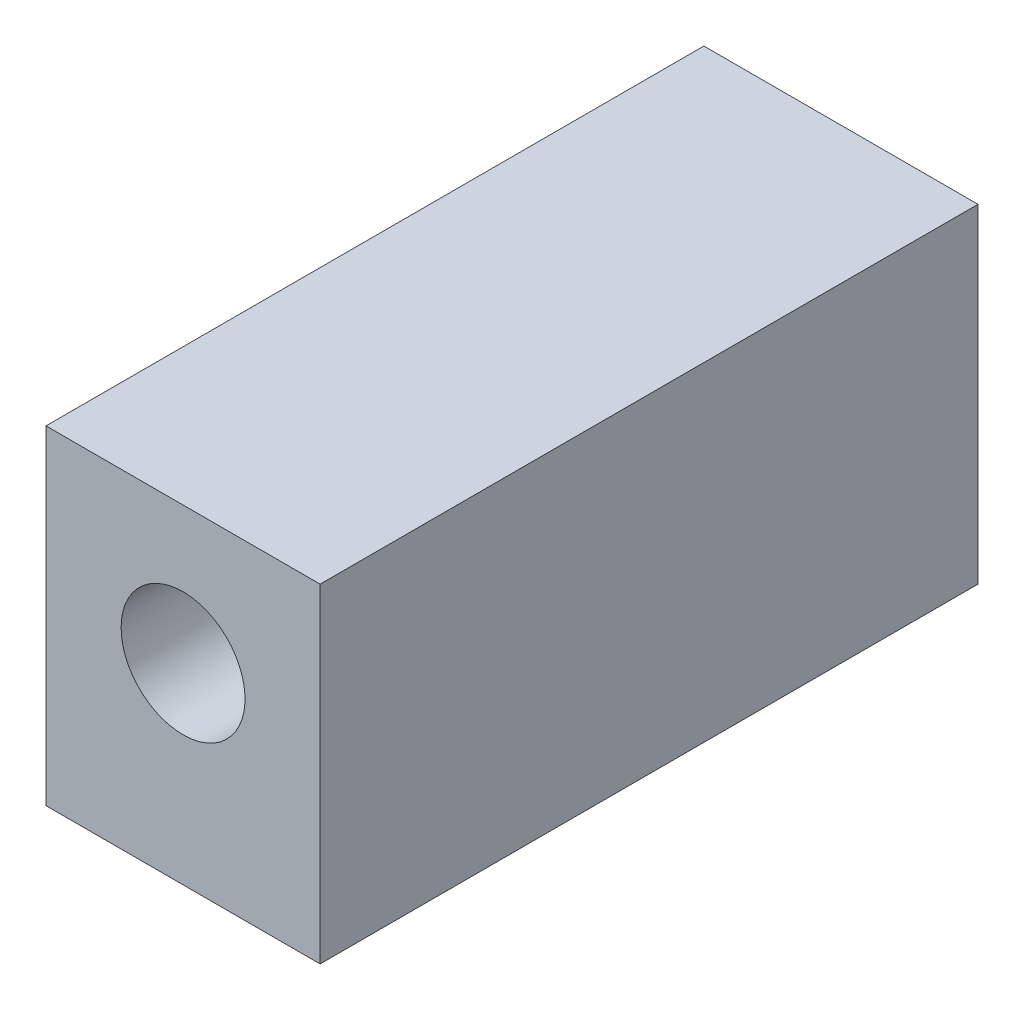
ISO-10303-21;
HEADER;
FILE_DESCRIPTION(('STEP AP214'),'2;1');
FILE_NAME('part.step','',(''),(''),'','','');
FILE_SCHEMA(('AUTOMOTIVE_DESIGN { 1 0 10303 214 1 1 1 1 }'));
ENDSEC;
DATA;
#1=APPLICATION_CONTEXT('core data for automotive mechanical design processes');
#2=APPLICATION_PROTOCOL_DEFINITION('international standard','automotive_design',2000,#1);
#3=PRODUCT_CONTEXT('',#1,'mechanical');
#4=PRODUCT('Part','Part','',(#3));
#5=PRODUCT_RELATED_PRODUCT_CATEGORY('part','',(#4));
#6=PRODUCT_DEFINITION_FORMATION('','',#4);
#7=PRODUCT_DEFINITION_CONTEXT('part definition',#1,'design');
#8=PRODUCT_DEFINITION('design','',#6,#7);
#9=PRODUCT_DEFINITION_SHAPE('','',#8);
#10=(LENGTH_UNIT() NAMED_UNIT(*) SI_UNIT(.MILLI.,.METRE.));
#11=(NAMED_UNIT(*) PLANE_ANGLE_UNIT() SI_UNIT($,.RADIAN.));
#12=(NAMED_UNIT(*) SI_UNIT($,.STERADIAN.) SOLID_ANGLE_UNIT());
#13=UNCERTAINTY_MEASURE_WITH_UNIT(LENGTH_MEASURE(1.E-05),#10,'distance_accuracy_value','');
#14=(GEOMETRIC_REPRESENTATION_CONTEXT(3) GLOBAL_UNCERTAINTY_ASSIGNED_CONTEXT((#13)) GLOBAL_UNIT_ASSIGNED_CONTEXT((#10,
#11,#12)) REPRESENTATION_CONTEXT('',''));
#15=CARTESIAN_POINT('',(0.,0.,0.));
#16=DIRECTION('',(0.,0.,1.));
#17=DIRECTION('',(1.,0.,0.));
#18=AXIS2_PLACEMENT_3D('',#15,#16,#17);
#19=CARTESIAN_POINT('',(-10.5821121778676,11.8684210526316,60.));
#20=DIRECTION('',(1.,0.,0.));
#21=DIRECTION('',(0.,1.,0.));
#22=AXIS2_PLACEMENT_3D('',#19,#20,#21);
#23=PLANE('',#22);
#24=DIRECTION('',(0.,-1.,0.));
#25=VECTOR('',#24,1.);
#26=CARTESIAN_POINT('',(-10.5821121778676,11.8684210526316,0.));
#27=LINE('',#26,#25);
#28=CARTESIAN_POINT('',(-10.5821121778676,11.8684210526316,0.));
#29=VERTEX_POINT('',#28);
#30=CARTESIAN_POINT('',(-10.5821121778676,-18.1315789473684,0.));
#31=VERTEX_POINT('',#30);
#32=EDGE_CURVE('E96',#29,#31,#27,.T.);
#33=ORIENTED_EDGE('',*,*,#32,.T.);
#34=DIRECTION('',(0.,0.,-1.));
#35=VECTOR('',#34,1.);
#36=CARTESIAN_POINT('',(-10.5821121778676,-18.1315789473684,60.));
#37=LINE('',#36,#35);
#38=CARTESIAN_POINT('',(-10.5821121778676,-18.1315789473684,60.));
#39=VERTEX_POINT('',#38);
#40=EDGE_CURVE('E11',#39,#31,#37,.T.);
#41=ORIENTED_EDGE('',*,*,#40,.F.);
#42=DIRECTION('',(0.,-1.,0.));
#43=VECTOR('',#42,1.);
#44=CARTESIAN_POINT('',(-10.5821121778676,11.8684210526316,60.));
#45=LINE('',#44,#43);
#46=CARTESIAN_POINT('',(-10.5821121778676,11.8684210526316,60.));
#47=VERTEX_POINT('',#46);
#48=EDGE_CURVE('E84',#47,#39,#45,.T.);
#49=ORIENTED_EDGE('',*,*,#48,.F.);
#50=DIRECTION('',(0.,0.,-1.));
#51=VECTOR('',#50,1.);
#52=CARTESIAN_POINT('',(-10.5821121778676,11.8684210526316,60.));
#53=LINE('',#52,#51);
#54=EDGE_CURVE('E92',#47,#29,#53,.T.);
#55=ORIENTED_EDGE('',*,*,#54,.T.);
#56=EDGE_LOOP('',(#33,#41,#49,#55));
#57=FACE_BOUND('',#56,.T.);
#58=ADVANCED_FACE('F33',(#57),#23,.F.);
#59=CARTESIAN_POINT('',(-10.5821121778676,-18.1315789473684,60.));
#60=DIRECTION('',(0.,1.,0.));
#61=DIRECTION('',(0.,0.,1.));
#62=AXIS2_PLACEMENT_3D('',#59,#60,#61);
#63=PLANE('',#62);
#64=DIRECTION('',(1.,0.,0.));
#65=VECTOR('',#64,1.);
#66=CARTESIAN_POINT('',(-10.5821121778676,-18.1315789473684,0.));
#67=LINE('',#66,#65);
#68=CARTESIAN_POINT('',(14.4178878221324,-18.1315789473684,0.));
#69=VERTEX_POINT('',#68);
#70=EDGE_CURVE('E88',#31,#69,#67,.T.);
#71=ORIENTED_EDGE('',*,*,#70,.T.);
#72=DIRECTION('',(0.,0.,-1.));
#73=VECTOR('',#72,1.);
#74=CARTESIAN_POINT('',(14.4178878221324,-18.1315789473684,60.));
#75=LINE('',#74,#73);
#76=CARTESIAN_POINT('',(14.4178878221324,-18.1315789473684,60.));
#77=VERTEX_POINT('',#76);
#78=EDGE_CURVE('E41',#77,#69,#75,.T.);
#79=ORIENTED_EDGE('',*,*,#78,.F.);
#80=DIRECTION('',(1.,0.,0.));
#81=VECTOR('',#80,1.);
#82=CARTESIAN_POINT('',(-10.5821121778676,-18.1315789473684,60.));
#83=LINE('',#82,#81);
#84=EDGE_CURVE('E79',#39,#77,#83,.T.);
#85=ORIENTED_EDGE('',*,*,#84,.F.);
#86=ORIENTED_EDGE('',*,*,#40,.T.);
#87=EDGE_LOOP('',(#71,#79,#85,#86));
#88=FACE_BOUND('',#87,.T.);
#89=ADVANCED_FACE('F87',(#88),#63,.F.);
#90=CARTESIAN_POINT('',(14.4178878221324,11.8684210526316,60.));
#91=DIRECTION('',(-1.,0.,0.));
#92=DIRECTION('',(0.,-1.,0.));
#93=AXIS2_PLACEMENT_3D('',#90,#91,#92);
#94=PLANE('',#93);
#95=DIRECTION('',(0.,1.,0.));
#96=VECTOR('',#95,1.);
#97=CARTESIAN_POINT('',(14.4178878221324,11.8684210526316,0.));
#98=LINE('',#97,#96);
#99=CARTESIAN_POINT('',(14.4178878221324,11.8684210526316,0.));
#100=VERTEX_POINT('',#99);
#101=EDGE_CURVE('E66',#69,#100,#98,.T.);
#102=ORIENTED_EDGE('',*,*,#101,.T.);
#103=DIRECTION('',(0.,0.,-1.));
#104=VECTOR('',#103,1.);
#105=CARTESIAN_POINT('',(14.4178878221324,11.8684210526316,60.));
#106=LINE('',#105,#104);
#107=CARTESIAN_POINT('',(14.4178878221324,11.8684210526316,60.));
#108=VERTEX_POINT('',#107);
#109=EDGE_CURVE('E89',#108,#100,#106,.T.);
#110=ORIENTED_EDGE('',*,*,#109,.F.);
#111=DIRECTION('',(0.,1.,0.));
#112=VECTOR('',#111,1.);
#113=CARTESIAN_POINT('',(14.4178878221324,11.8684210526316,60.));
#114=LINE('',#113,#112);
#115=EDGE_CURVE('E82',#77,#108,#114,.T.);
#116=ORIENTED_EDGE('',*,*,#115,.F.);
#117=ORIENTED_EDGE('',*,*,#78,.T.);
#118=EDGE_LOOP('',(#102,#110,#116,#117));
#119=FACE_BOUND('',#118,.T.);
#120=ADVANCED_FACE('F90',(#119),#94,.F.);
#121=CARTESIAN_POINT('',(-10.5821121778676,11.8684210526316,60.));
#122=DIRECTION('',(0.,-1.,0.));
#123=DIRECTION('',(0.,0.,-1.));
#124=AXIS2_PLACEMENT_3D('',#121,#122,#123);
#125=PLANE('',#124);
#126=DIRECTION('',(-1.,0.,0.));
#127=VECTOR('',#126,1.);
#128=CARTESIAN_POINT('',(-10.5821121778676,11.8684210526316,0.));
#129=LINE('',#128,#127);
#130=EDGE_CURVE('E72',#100,#29,#129,.T.);
#131=ORIENTED_EDGE('',*,*,#130,.T.);
#132=ORIENTED_EDGE('',*,*,#54,.F.);
#133=DIRECTION('',(-1.,0.,0.));
#134=VECTOR('',#133,1.);
#135=CARTESIAN_POINT('',(-10.5821121778676,11.8684210526316,60.));
#136=LINE('',#135,#134);
#137=EDGE_CURVE('E49',#108,#47,#136,.T.);
#138=ORIENTED_EDGE('',*,*,#137,.F.);
#139=ORIENTED_EDGE('',*,*,#109,.T.);
#140=EDGE_LOOP('',(#131,#132,#138,#139));
#141=FACE_BOUND('',#140,.T.);
#142=ADVANCED_FACE('F104',(#141),#125,.F.);
#143=CARTESIAN_POINT('',(0.,0.,60.));
#144=DIRECTION('',(0.,0.,1.));
#145=DIRECTION('',(1.,0.,0.));
#146=AXIS2_PLACEMENT_3D('',#143,#144,#145);
#147=PLANE('',#146);
#148=CARTESIAN_POINT('',(1.91788782213238,-0.631578947368421,60.));
#149=DIRECTION('',(0.,0.,-1.));
#150=DIRECTION('',(-1.,0.,0.));
#151=AXIS2_PLACEMENT_3D('',#148,#149,#150);
#152=CIRCLE('',#151,5.65);
#153=CARTESIAN_POINT('',(-3.73211217786762,-0.631578947368421,60.));
#154=VERTEX_POINT('',#153);
#155=EDGE_CURVE('E113',#154,#154,#152,.T.);
#156=ORIENTED_EDGE('',*,*,#155,.T.);
#157=EDGE_LOOP('',(#156));
#158=FACE_BOUND('',#157,.T.);
#159=ORIENTED_EDGE('',*,*,#48,.T.);
#160=ORIENTED_EDGE('',*,*,#84,.T.);
#161=ORIENTED_EDGE('',*,*,#115,.T.);
#162=ORIENTED_EDGE('',*,*,#137,.T.);
#163=EDGE_LOOP('',(#159,#160,#161,#162));
#164=FACE_BOUND('',#163,.T.);
#165=ADVANCED_FACE('F80',(#158,#164),#147,.T.);
#166=CARTESIAN_POINT('',(0.,0.,0.));
#167=DIRECTION('',(0.,0.,1.));
#168=DIRECTION('',(1.,0.,0.));
#169=AXIS2_PLACEMENT_3D('',#166,#167,#168);
#170=PLANE('',#169);
#171=CARTESIAN_POINT('',(1.91788782213238,-0.631578947368421,0.));
#172=DIRECTION('',(0.,0.,-1.));
#173=DIRECTION('',(-1.,0.,0.));
#174=AXIS2_PLACEMENT_3D('',#171,#172,#173);
#175=CIRCLE('',#174,9.6);
#176=CARTESIAN_POINT('',(-7.68211217786761,-0.631578947368421,0.));
#177=VERTEX_POINT('',#176);
#178=EDGE_CURVE('E110',#177,#177,#175,.T.);
#179=ORIENTED_EDGE('',*,*,#178,.F.);
#180=EDGE_LOOP('',(#179));
#181=FACE_BOUND('',#180,.T.);
#182=ORIENTED_EDGE('',*,*,#32,.F.);
#183=ORIENTED_EDGE('',*,*,#130,.F.);
#184=ORIENTED_EDGE('',*,*,#101,.F.);
#185=ORIENTED_EDGE('',*,*,#70,.F.);
#186=EDGE_LOOP('',(#182,#183,#184,#185));
#187=FACE_BOUND('',#186,.T.);
#188=ADVANCED_FACE('F107',(#181,#187),#170,.F.);
#189=CARTESIAN_POINT('',(1.91788782213238,-0.631578947368421,47.5));
#190=DIRECTION('',(0.,0.,-1.));
#191=DIRECTION('',(-1.,0.,0.));
#192=AXIS2_PLACEMENT_3D('',#189,#190,#191);
#193=CYLINDRICAL_SURFACE('',#192,9.6);
#194=CARTESIAN_POINT('',(1.91788782213238,-0.631578947368421,47.5));
#195=DIRECTION('',(0.,0.,-1.));
#196=DIRECTION('',(-1.,0.,0.));
#197=AXIS2_PLACEMENT_3D('',#194,#195,#196);
#198=CIRCLE('',#197,9.6);
#199=CARTESIAN_POINT('',(-7.68211217786761,-0.631578947368421,47.5));
#200=VERTEX_POINT('',#199);
#201=EDGE_CURVE('E99',#200,#200,#198,.T.);
#202=ORIENTED_EDGE('',*,*,#201,.F.);
#203=EDGE_LOOP('',(#202));
#204=FACE_BOUND('',#203,.T.);
#205=ORIENTED_EDGE('',*,*,#178,.T.);
#206=EDGE_LOOP('',(#205));
#207=FACE_BOUND('',#206,.T.);
#208=ADVANCED_FACE('F132',(#204,#207),#193,.F.);
#209=CARTESIAN_POINT('',(1.91788782213238,-0.631578947368421,47.5));
#210=DIRECTION('',(0.,0.,-1.));
#211=DIRECTION('',(-1.,0.,0.));
#212=AXIS2_PLACEMENT_3D('',#209,#210,#211);
#213=PLANE('',#212);
#214=CARTESIAN_POINT('',(1.91788782213238,-0.631578947368421,47.5));
#215=DIRECTION('',(0.,0.,-1.));
#216=DIRECTION('',(-1.,0.,0.));
#217=AXIS2_PLACEMENT_3D('',#214,#215,#216);
#218=CIRCLE('',#217,5.65);
#219=CARTESIAN_POINT('',(-3.73211217786762,-0.631578947368421,47.5));
#220=VERTEX_POINT('',#219);
#221=EDGE_CURVE('E116',#220,#220,#218,.T.);
#222=ORIENTED_EDGE('',*,*,#221,.F.);
#223=EDGE_LOOP('',(#222));
#224=FACE_BOUND('',#223,.T.);
#225=ORIENTED_EDGE('',*,*,#201,.T.);
#226=EDGE_LOOP('',(#225));
#227=FACE_BOUND('',#226,.T.);
#228=ADVANCED_FACE('F126',(#224,#227),#213,.T.);
#229=CARTESIAN_POINT('',(1.91788782213238,-0.631578947368421,60.));
#230=DIRECTION('',(0.,0.,-1.));
#231=DIRECTION('',(-1.,0.,0.));
#232=AXIS2_PLACEMENT_3D('',#229,#230,#231);
#233=CYLINDRICAL_SURFACE('',#232,5.65);
#234=ORIENTED_EDGE('',*,*,#155,.F.);
#235=EDGE_LOOP('',(#234));
#236=FACE_BOUND('',#235,.T.);
#237=ORIENTED_EDGE('',*,*,#221,.T.);
#238=EDGE_LOOP('',(#237));
#239=FACE_BOUND('',#238,.T.);
#240=ADVANCED_FACE('F123',(#236,#239),#233,.F.);
#241=CLOSED_SHELL('',(#58,#89,#120,#142,#165,#188,#208,#228,#240));
#242=MANIFOLD_SOLID_BREP('B2',#241);
#243=ADVANCED_BREP_SHAPE_REPRESENTATION('',(#18,#242),#14);
#244=SHAPE_DEFINITION_REPRESENTATION(#9,#243);
ENDSEC;
END-ISO-10303-21;
